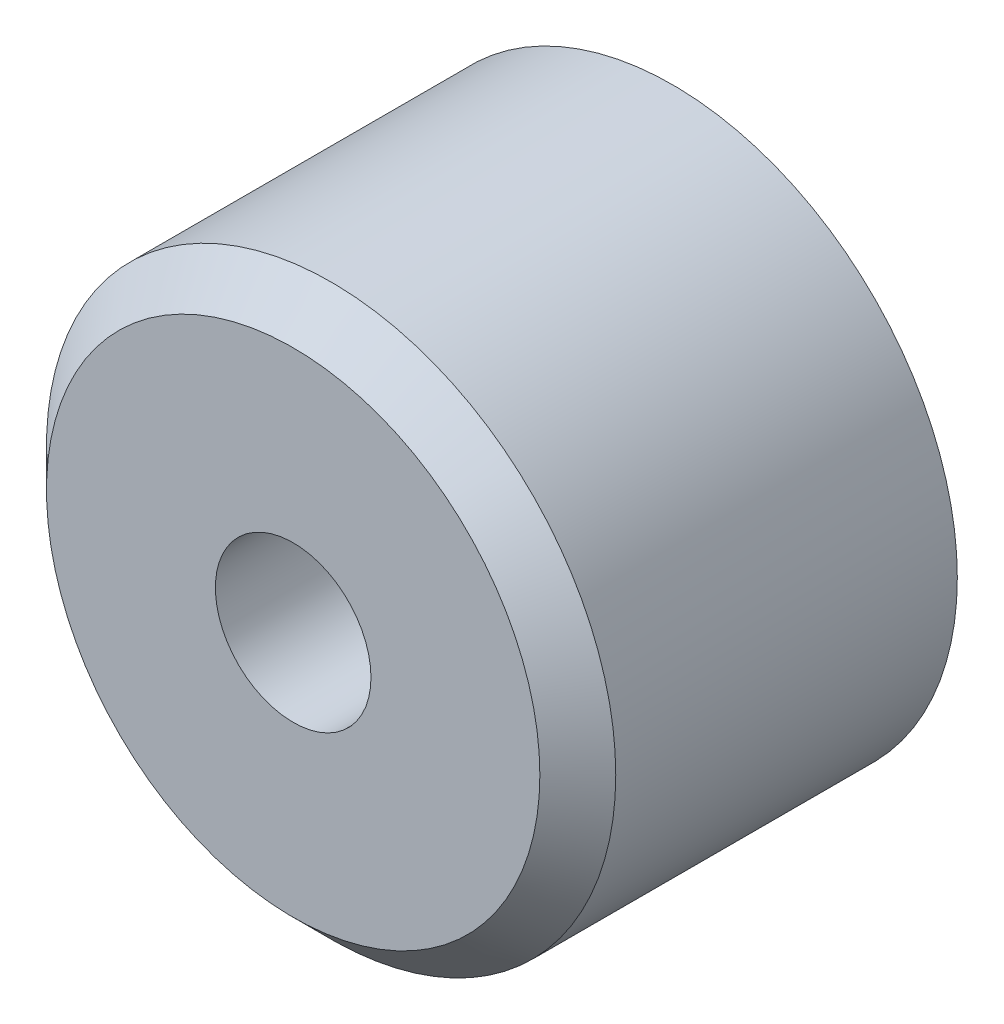
ISO-10303-21;
HEADER;
FILE_DESCRIPTION(('STEP AP214'),'2;1');
FILE_NAME('part.step','',(''),(''),'','','');
FILE_SCHEMA(('AUTOMOTIVE_DESIGN { 1 0 10303 214 1 1 1 1 }'));
ENDSEC;
DATA;
#1=APPLICATION_CONTEXT('core data for automotive mechanical design processes');
#2=APPLICATION_PROTOCOL_DEFINITION('international standard','automotive_design',2000,#1);
#3=PRODUCT_CONTEXT('',#1,'mechanical');
#4=PRODUCT('Part','Part','',(#3));
#5=PRODUCT_RELATED_PRODUCT_CATEGORY('part','',(#4));
#6=PRODUCT_DEFINITION_FORMATION('','',#4);
#7=PRODUCT_DEFINITION_CONTEXT('part definition',#1,'design');
#8=PRODUCT_DEFINITION('design','',#6,#7);
#9=PRODUCT_DEFINITION_SHAPE('','',#8);
#10=(LENGTH_UNIT() NAMED_UNIT(*) SI_UNIT(.MILLI.,.METRE.));
#11=(NAMED_UNIT(*) PLANE_ANGLE_UNIT() SI_UNIT($,.RADIAN.));
#12=(NAMED_UNIT(*) SI_UNIT($,.STERADIAN.) SOLID_ANGLE_UNIT());
#13=UNCERTAINTY_MEASURE_WITH_UNIT(LENGTH_MEASURE(1.E-05),#10,'distance_accuracy_value','');
#14=(GEOMETRIC_REPRESENTATION_CONTEXT(3) GLOBAL_UNCERTAINTY_ASSIGNED_CONTEXT((#13)) GLOBAL_UNIT_ASSIGNED_CONTEXT((#10,
#11,#12)) REPRESENTATION_CONTEXT('',''));
#15=CARTESIAN_POINT('',(0.,0.,0.));
#16=DIRECTION('',(0.,0.,1.));
#17=DIRECTION('',(1.,0.,0.));
#18=AXIS2_PLACEMENT_3D('',#15,#16,#17);
#19=CARTESIAN_POINT('',(0.,0.,0.));
#20=DIRECTION('',(0.,0.,1.));
#21=DIRECTION('',(1.,0.,0.));
#22=AXIS2_PLACEMENT_3D('',#19,#20,#21);
#23=PLANE('',#22);
#24=CARTESIAN_POINT('',(0.,0.,0.));
#25=DIRECTION('',(0.,0.,1.));
#26=DIRECTION('',(1.,0.,0.));
#27=AXIS2_PLACEMENT_3D('',#24,#25,#26);
#28=CIRCLE('',#27,7.5);
#29=CARTESIAN_POINT('',(7.5,0.,0.));
#30=VERTEX_POINT('',#29);
#31=EDGE_CURVE('E47',#30,#30,#28,.T.);
#32=ORIENTED_EDGE('',*,*,#31,.F.);
#33=EDGE_LOOP('',(#32));
#34=FACE_BOUND('',#33,.T.);
#35=CARTESIAN_POINT('',(0.,0.,0.));
#36=DIRECTION('',(0.,0.,1.));
#37=DIRECTION('',(1.,0.,0.));
#38=AXIS2_PLACEMENT_3D('',#35,#36,#37);
#39=CIRCLE('',#38,5.05);
#40=CARTESIAN_POINT('',(5.05,0.,0.));
#41=VERTEX_POINT('',#40);
#42=EDGE_CURVE('E50',#41,#41,#39,.T.);
#43=ORIENTED_EDGE('',*,*,#42,.T.);
#44=EDGE_LOOP('',(#43));
#45=FACE_BOUND('',#44,.T.);
#46=ADVANCED_FACE('F32',(#34,#45),#23,.F.);
#47=CARTESIAN_POINT('',(0.,0.,22.2132034355964));
#48=DIRECTION('',(0.,0.,-1.));
#49=DIRECTION('',(-1.,0.,0.));
#50=AXIS2_PLACEMENT_3D('',#47,#48,#49);
#51=CYLINDRICAL_SURFACE('',#50,7.5);
#52=CARTESIAN_POINT('',(0.,0.,9.00000000000953));
#53=DIRECTION('',(0.,0.,1.));
#54=DIRECTION('',(1.,0.,0.));
#55=AXIS2_PLACEMENT_3D('',#52,#53,#54);
#56=CIRCLE('',#55,7.5);
#57=CARTESIAN_POINT('',(7.5,0.,9.00000000000953));
#58=VERTEX_POINT('',#57);
#59=EDGE_CURVE('E10',#58,#58,#56,.F.);
#60=ORIENTED_EDGE('',*,*,#59,.T.);
#61=EDGE_LOOP('',(#60));
#62=FACE_BOUND('',#61,.T.);
#63=ORIENTED_EDGE('',*,*,#31,.T.);
#64=EDGE_LOOP('',(#63));
#65=FACE_BOUND('',#64,.T.);
#66=ADVANCED_FACE('F78',(#62,#65),#51,.T.);
#67=CARTESIAN_POINT('',(0.,0.,22.2132034355964));
#68=DIRECTION('',(0.,0.,-1.));
#69=DIRECTION('',(-1.,0.,0.));
#70=AXIS2_PLACEMENT_3D('',#67,#68,#69);
#71=CYLINDRICAL_SURFACE('',#70,5.05);
#72=CARTESIAN_POINT('',(0.,0.,1.));
#73=DIRECTION('',(0.,0.,-1.));
#74=DIRECTION('',(-1.,0.,0.));
#75=AXIS2_PLACEMENT_3D('',#72,#73,#74);
#76=CIRCLE('',#75,5.05);
#77=CARTESIAN_POINT('',(-5.05,0.,1.));
#78=VERTEX_POINT('',#77);
#79=EDGE_CURVE('E43',#78,#78,#76,.T.);
#80=ORIENTED_EDGE('',*,*,#79,.F.);
#81=EDGE_LOOP('',(#80));
#82=FACE_BOUND('',#81,.T.);
#83=ORIENTED_EDGE('',*,*,#42,.F.);
#84=EDGE_LOOP('',(#83));
#85=FACE_BOUND('',#84,.T.);
#86=ADVANCED_FACE('F74',(#82,#85),#71,.F.);
#87=CARTESIAN_POINT('',(-4.9509650235103E-12,4.64928242283385E-13,1.));
#88=DIRECTION('',(0.,0.,1.));
#89=DIRECTION('',(1.,0.,0.));
#90=AXIS2_PLACEMENT_3D('',#87,#88,#89);
#91=PLANE('',#90);
#92=CARTESIAN_POINT('',(-4.9509650235103E-12,4.64928242283385E-13,1.));
#93=DIRECTION('',(0.,0.,1.));
#94=DIRECTION('',(1.,0.,0.));
#95=AXIS2_PLACEMENT_3D('',#92,#93,#94);
#96=CIRCLE('',#95,2.05000000000459);
#97=CARTESIAN_POINT('',(2.04999999999964,4.64928242283385E-13,1.));
#98=VERTEX_POINT('',#97);
#99=EDGE_CURVE('E56',#98,#98,#96,.T.);
#100=ORIENTED_EDGE('',*,*,#99,.T.);
#101=EDGE_LOOP('',(#100));
#102=FACE_BOUND('',#101,.T.);
#103=ORIENTED_EDGE('',*,*,#79,.T.);
#104=EDGE_LOOP('',(#103));
#105=FACE_BOUND('',#104,.T.);
#106=ADVANCED_FACE('F67',(#102,#105),#91,.F.);
#107=CARTESIAN_POINT('',(-4.9509650235103E-12,4.64928242283385E-13,10.));
#108=DIRECTION('',(0.,0.,1.));
#109=DIRECTION('',(1.,0.,0.));
#110=AXIS2_PLACEMENT_3D('',#107,#108,#109);
#111=PLANE('',#110);
#112=CARTESIAN_POINT('',(0.,0.,10.));
#113=DIRECTION('',(0.,0.,1.));
#114=DIRECTION('',(1.,0.,0.));
#115=AXIS2_PLACEMENT_3D('',#112,#113,#114);
#116=CIRCLE('',#115,6.50000000000953);
#117=CARTESIAN_POINT('',(6.50000000000953,0.,10.));
#118=VERTEX_POINT('',#117);
#119=EDGE_CURVE('E39',#118,#118,#116,.T.);
#120=ORIENTED_EDGE('',*,*,#119,.T.);
#121=EDGE_LOOP('',(#120));
#122=FACE_BOUND('',#121,.T.);
#123=CARTESIAN_POINT('',(-4.9509650235103E-12,4.64928242283385E-13,10.));
#124=DIRECTION('',(0.,0.,1.));
#125=DIRECTION('',(1.,0.,0.));
#126=AXIS2_PLACEMENT_3D('',#123,#124,#125);
#127=CIRCLE('',#126,2.05000000000459);
#128=CARTESIAN_POINT('',(2.04999999999964,4.64928242283385E-13,10.));
#129=VERTEX_POINT('',#128);
#130=EDGE_CURVE('E53',#129,#129,#127,.T.);
#131=ORIENTED_EDGE('',*,*,#130,.F.);
#132=EDGE_LOOP('',(#131));
#133=FACE_BOUND('',#132,.T.);
#134=ADVANCED_FACE('F65',(#122,#133),#111,.T.);
#135=CARTESIAN_POINT('',(-4.9509650235103E-12,4.64928242283385E-13,10.));
#136=DIRECTION('',(0.,0.,-1.));
#137=DIRECTION('',(-1.,0.,0.));
#138=AXIS2_PLACEMENT_3D('',#135,#136,#137);
#139=CYLINDRICAL_SURFACE('',#138,2.05000000000459);
#140=ORIENTED_EDGE('',*,*,#130,.T.);
#141=EDGE_LOOP('',(#140));
#142=FACE_BOUND('',#141,.T.);
#143=ORIENTED_EDGE('',*,*,#99,.F.);
#144=EDGE_LOOP('',(#143));
#145=FACE_BOUND('',#144,.T.);
#146=ADVANCED_FACE('F62',(#142,#145),#139,.F.);
#147=CARTESIAN_POINT('',(0.,0.,10.));
#148=DIRECTION('',(0.,0.,-1.));
#149=DIRECTION('',(-1.,0.,0.));
#150=AXIS2_PLACEMENT_3D('',#147,#148,#149);
#151=CONICAL_SURFACE('',#150,6.50000000000953,0.785398163397448);
#152=ORIENTED_EDGE('',*,*,#59,.F.);
#153=EDGE_LOOP('',(#152));
#154=FACE_BOUND('',#153,.T.);
#155=ORIENTED_EDGE('',*,*,#119,.F.);
#156=EDGE_LOOP('',(#155));
#157=FACE_BOUND('',#156,.T.);
#158=ADVANCED_FACE('F34',(#154,#157),#151,.T.);
#159=CLOSED_SHELL('',(#46,#66,#86,#106,#134,#146,#158));
#160=MANIFOLD_SOLID_BREP('B2',#159);
#161=ADVANCED_BREP_SHAPE_REPRESENTATION('',(#18,#160),#14);
#162=SHAPE_DEFINITION_REPRESENTATION(#9,#161);
ENDSEC;
END-ISO-10303-21;
